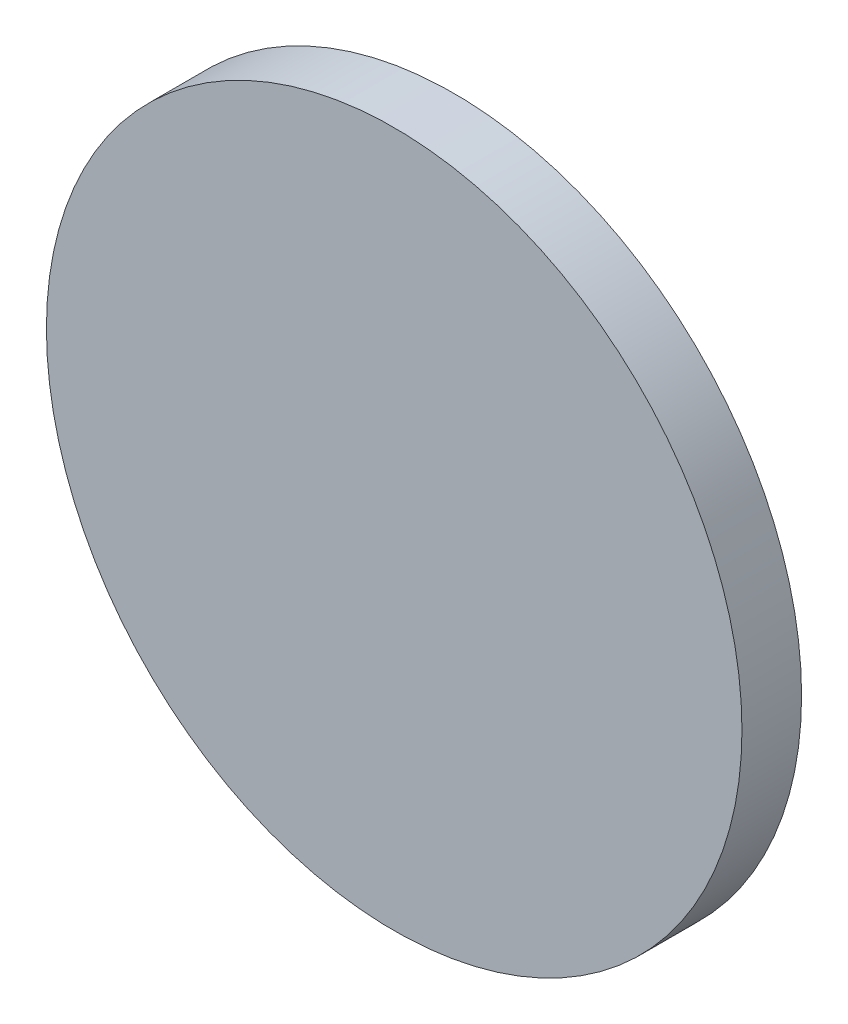
ISO-10303-21;
HEADER;
FILE_DESCRIPTION(('STEP AP214'),'2;1');
FILE_NAME('part.step','',(''),(''),'','','');
FILE_SCHEMA(('AUTOMOTIVE_DESIGN { 1 0 10303 214 1 1 1 1 }'));
ENDSEC;
DATA;
#1=APPLICATION_CONTEXT('core data for automotive mechanical design processes');
#2=APPLICATION_PROTOCOL_DEFINITION('international standard','automotive_design',2000,#1);
#3=PRODUCT_CONTEXT('',#1,'mechanical');
#4=PRODUCT('Part','Part','',(#3));
#5=PRODUCT_RELATED_PRODUCT_CATEGORY('part','',(#4));
#6=PRODUCT_DEFINITION_FORMATION('','',#4);
#7=PRODUCT_DEFINITION_CONTEXT('part definition',#1,'design');
#8=PRODUCT_DEFINITION('design','',#6,#7);
#9=PRODUCT_DEFINITION_SHAPE('','',#8);
#10=(LENGTH_UNIT() NAMED_UNIT(*) SI_UNIT(.MILLI.,.METRE.));
#11=(NAMED_UNIT(*) PLANE_ANGLE_UNIT() SI_UNIT($,.RADIAN.));
#12=(NAMED_UNIT(*) SI_UNIT($,.STERADIAN.) SOLID_ANGLE_UNIT());
#13=UNCERTAINTY_MEASURE_WITH_UNIT(LENGTH_MEASURE(1.E-05),#10,'distance_accuracy_value','');
#14=(GEOMETRIC_REPRESENTATION_CONTEXT(3) GLOBAL_UNCERTAINTY_ASSIGNED_CONTEXT((#13)) GLOBAL_UNIT_ASSIGNED_CONTEXT((#10,
#11,#12)) REPRESENTATION_CONTEXT('',''));
#15=CARTESIAN_POINT('',(0.,0.,0.));
#16=DIRECTION('',(0.,0.,1.));
#17=DIRECTION('',(1.,0.,0.));
#18=AXIS2_PLACEMENT_3D('',#15,#16,#17);
#19=CARTESIAN_POINT('',(11.527,6.787000014875,0.));
#20=DIRECTION('',(0.,0.,-1.));
#21=DIRECTION('',(-1.,0.,0.));
#22=AXIS2_PLACEMENT_3D('',#19,#20,#21);
#23=PLANE('',#22);
#24=CARTESIAN_POINT('',(11.527,6.787000014875,0.));
#25=DIRECTION('',(0.,0.,1.));
#26=DIRECTION('',(1.,0.,0.));
#27=AXIS2_PLACEMENT_3D('',#24,#25,#26);
#28=CIRCLE('',#27,0.200024667);
#29=CARTESIAN_POINT('',(11.727024667,6.787000014875,0.));
#30=VERTEX_POINT('',#29);
#31=EDGE_CURVE('E18',#30,#30,#28,.T.);
#32=ORIENTED_EDGE('',*,*,#31,.F.);
#33=EDGE_LOOP('',(#32));
#34=FACE_BOUND('',#33,.T.);
#35=ADVANCED_FACE('F15',(#34),#23,.T.);
#36=CARTESIAN_POINT('',(11.527,6.787000014875,0.));
#37=DIRECTION('',(0.,0.,1.));
#38=DIRECTION('',(1.,0.,0.));
#39=AXIS2_PLACEMENT_3D('',#36,#37,#38);
#40=CYLINDRICAL_SURFACE('',#39,0.200024667);
#41=CARTESIAN_POINT('',(11.527,6.787000014875,0.03429));
#42=DIRECTION('',(0.,0.,1.));
#43=DIRECTION('',(1.,0.,0.));
#44=AXIS2_PLACEMENT_3D('',#41,#42,#43);
#45=CIRCLE('',#44,0.200024667);
#46=CARTESIAN_POINT('',(11.727024667,6.787000014875,0.03429));
#47=VERTEX_POINT('',#46);
#48=EDGE_CURVE('E10',#47,#47,#45,.T.);
#49=ORIENTED_EDGE('',*,*,#48,.F.);
#50=EDGE_LOOP('',(#49));
#51=FACE_BOUND('',#50,.T.);
#52=ORIENTED_EDGE('',*,*,#31,.T.);
#53=EDGE_LOOP('',(#52));
#54=FACE_BOUND('',#53,.T.);
#55=ADVANCED_FACE('F27',(#51,#54),#40,.T.);
#56=CARTESIAN_POINT('',(11.527,6.787000014875,0.03429));
#57=DIRECTION('',(0.,0.,1.));
#58=DIRECTION('',(1.,0.,0.));
#59=AXIS2_PLACEMENT_3D('',#56,#57,#58);
#60=PLANE('',#59);
#61=ORIENTED_EDGE('',*,*,#48,.T.);
#62=EDGE_LOOP('',(#61));
#63=FACE_BOUND('',#62,.T.);
#64=ADVANCED_FACE('F34',(#63),#60,.T.);
#65=CLOSED_SHELL('',(#35,#55,#64));
#66=MANIFOLD_SOLID_BREP('B1',#65);
#67=ADVANCED_BREP_SHAPE_REPRESENTATION('',(#18,#66),#14);
#68=SHAPE_DEFINITION_REPRESENTATION(#9,#67);
ENDSEC;
END-ISO-10303-21;
